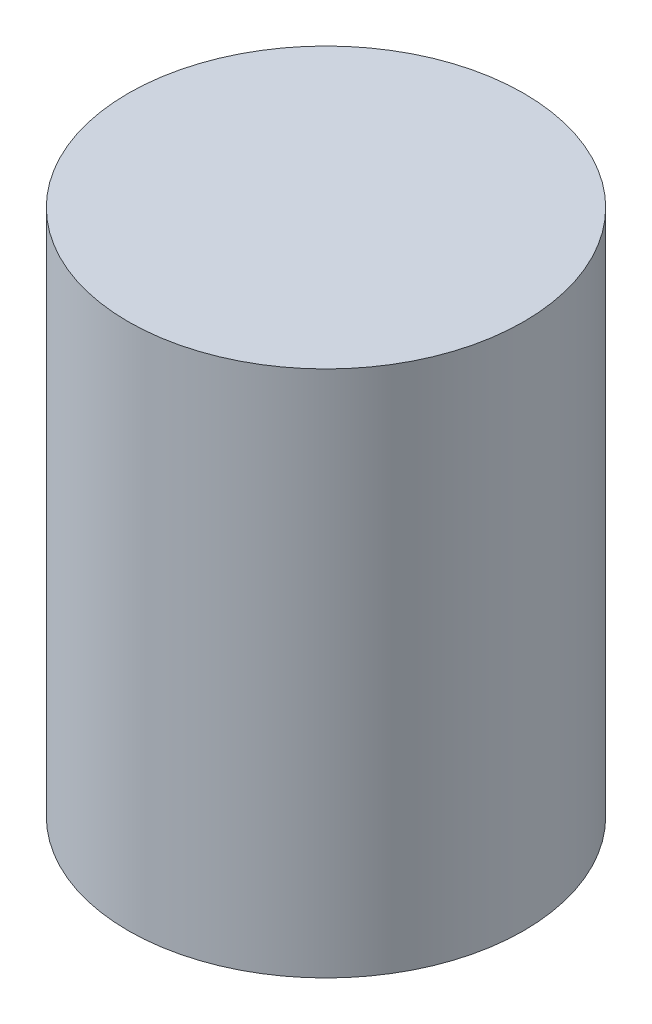
ISO-10303-21;
HEADER;
FILE_DESCRIPTION(('STEP AP214'),'2;1');
FILE_NAME('part.step','',(''),(''),'','','');
FILE_SCHEMA(('AUTOMOTIVE_DESIGN { 1 0 10303 214 1 1 1 1 }'));
ENDSEC;
DATA;
#1=APPLICATION_CONTEXT('core data for automotive mechanical design processes');
#2=APPLICATION_PROTOCOL_DEFINITION('international standard','automotive_design',2000,#1);
#3=PRODUCT_CONTEXT('',#1,'mechanical');
#4=PRODUCT('Part','Part','',(#3));
#5=PRODUCT_RELATED_PRODUCT_CATEGORY('part','',(#4));
#6=PRODUCT_DEFINITION_FORMATION('','',#4);
#7=PRODUCT_DEFINITION_CONTEXT('part definition',#1,'design');
#8=PRODUCT_DEFINITION('design','',#6,#7);
#9=PRODUCT_DEFINITION_SHAPE('','',#8);
#10=(LENGTH_UNIT() NAMED_UNIT(*) SI_UNIT(.MILLI.,.METRE.));
#11=(NAMED_UNIT(*) PLANE_ANGLE_UNIT() SI_UNIT($,.RADIAN.));
#12=(NAMED_UNIT(*) SI_UNIT($,.STERADIAN.) SOLID_ANGLE_UNIT());
#13=UNCERTAINTY_MEASURE_WITH_UNIT(LENGTH_MEASURE(1.E-05),#10,'distance_accuracy_value','');
#14=(GEOMETRIC_REPRESENTATION_CONTEXT(3) GLOBAL_UNCERTAINTY_ASSIGNED_CONTEXT((#13)) GLOBAL_UNIT_ASSIGNED_CONTEXT((#10,
#11,#12)) REPRESENTATION_CONTEXT('',''));
#15=CARTESIAN_POINT('',(0.,0.,0.));
#16=DIRECTION('',(0.,0.,1.));
#17=DIRECTION('',(1.,0.,0.));
#18=AXIS2_PLACEMENT_3D('',#15,#16,#17);
#19=CARTESIAN_POINT('',(0.,80.,0.));
#20=DIRECTION('',(0.,-1.,0.));
#21=DIRECTION('',(0.,0.,-1.));
#22=AXIS2_PLACEMENT_3D('',#19,#20,#21);
#23=CYLINDRICAL_SURFACE('',#22,30.);
#24=CARTESIAN_POINT('',(0.,80.,0.));
#25=DIRECTION('',(0.,1.,0.));
#26=DIRECTION('',(0.,0.,1.));
#27=AXIS2_PLACEMENT_3D('',#24,#25,#26);
#28=CIRCLE('',#27,30.);
#29=CARTESIAN_POINT('',(0.,80.,30.));
#30=VERTEX_POINT('',#29);
#31=EDGE_CURVE('E10',#30,#30,#28,.T.);
#32=ORIENTED_EDGE('',*,*,#31,.F.);
#33=EDGE_LOOP('',(#32));
#34=FACE_BOUND('',#33,.T.);
#35=CARTESIAN_POINT('',(0.,0.,0.));
#36=DIRECTION('',(0.,1.,0.));
#37=DIRECTION('',(0.,0.,1.));
#38=AXIS2_PLACEMENT_3D('',#35,#36,#37);
#39=CIRCLE('',#38,30.);
#40=CARTESIAN_POINT('',(0.,0.,30.));
#41=VERTEX_POINT('',#40);
#42=EDGE_CURVE('E34',#41,#41,#39,.T.);
#43=ORIENTED_EDGE('',*,*,#42,.T.);
#44=EDGE_LOOP('',(#43));
#45=FACE_BOUND('',#44,.T.);
#46=ADVANCED_FACE('F31',(#34,#45),#23,.T.);
#47=CARTESIAN_POINT('',(0.,80.,0.));
#48=DIRECTION('',(0.,1.,0.));
#49=DIRECTION('',(0.,0.,1.));
#50=AXIS2_PLACEMENT_3D('',#47,#48,#49);
#51=PLANE('',#50);
#52=ORIENTED_EDGE('',*,*,#31,.T.);
#53=EDGE_LOOP('',(#52));
#54=FACE_BOUND('',#53,.T.);
#55=ADVANCED_FACE('F46',(#54),#51,.T.);
#56=CARTESIAN_POINT('',(0.,0.,0.));
#57=DIRECTION('',(0.,1.,0.));
#58=DIRECTION('',(0.,0.,1.));
#59=AXIS2_PLACEMENT_3D('',#56,#57,#58);
#60=PLANE('',#59);
#61=ORIENTED_EDGE('',*,*,#42,.F.);
#62=EDGE_LOOP('',(#61));
#63=FACE_BOUND('',#62,.T.);
#64=ADVANCED_FACE('F44',(#63),#60,.F.);
#65=CLOSED_SHELL('',(#46,#55,#64));
#66=MANIFOLD_SOLID_BREP('B2',#65);
#67=ADVANCED_BREP_SHAPE_REPRESENTATION('',(#18,#66),#14);
#68=SHAPE_DEFINITION_REPRESENTATION(#9,#67);
ENDSEC;
END-ISO-10303-21;
